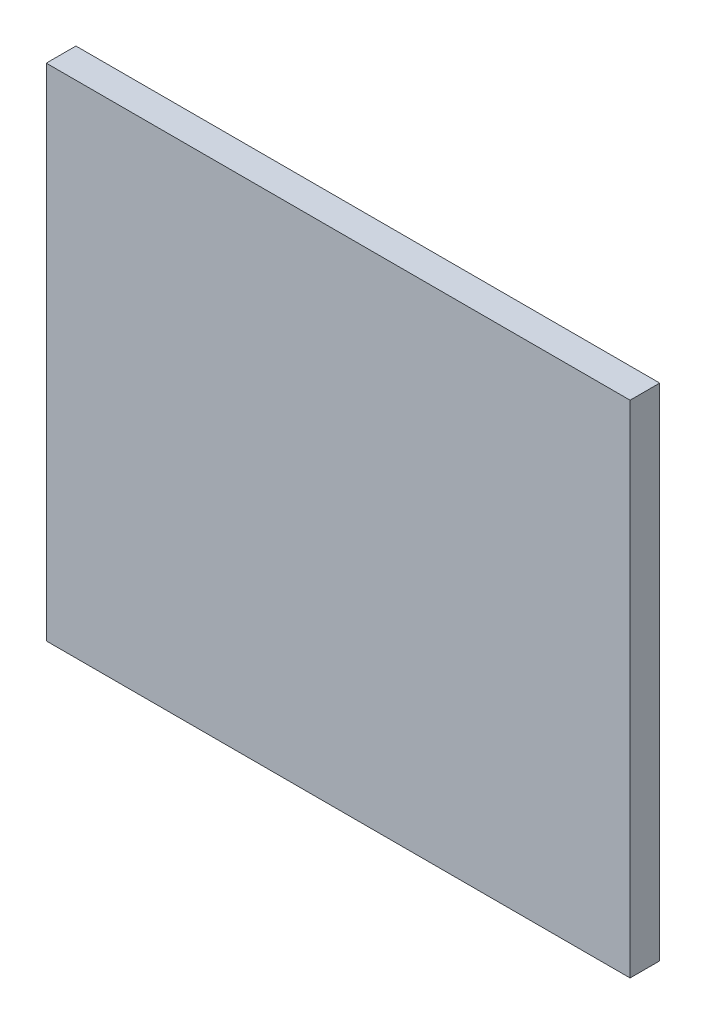
ISO-10303-21;
HEADER;
FILE_DESCRIPTION(('STEP AP214'),'2;1');
FILE_NAME('part.step','',(''),(''),'','','');
FILE_SCHEMA(('AUTOMOTIVE_DESIGN { 1 0 10303 214 1 1 1 1 }'));
ENDSEC;
DATA;
#1=APPLICATION_CONTEXT('core data for automotive mechanical design processes');
#2=APPLICATION_PROTOCOL_DEFINITION('international standard','automotive_design',2000,#1);
#3=PRODUCT_CONTEXT('',#1,'mechanical');
#4=PRODUCT('Part','Part','',(#3));
#5=PRODUCT_RELATED_PRODUCT_CATEGORY('part','',(#4));
#6=PRODUCT_DEFINITION_FORMATION('','',#4);
#7=PRODUCT_DEFINITION_CONTEXT('part definition',#1,'design');
#8=PRODUCT_DEFINITION('design','',#6,#7);
#9=PRODUCT_DEFINITION_SHAPE('','',#8);
#10=(LENGTH_UNIT() NAMED_UNIT(*) SI_UNIT(.MILLI.,.METRE.));
#11=(NAMED_UNIT(*) PLANE_ANGLE_UNIT() SI_UNIT($,.RADIAN.));
#12=(NAMED_UNIT(*) SI_UNIT($,.STERADIAN.) SOLID_ANGLE_UNIT());
#13=UNCERTAINTY_MEASURE_WITH_UNIT(LENGTH_MEASURE(1.E-05),#10,'distance_accuracy_value','');
#14=(GEOMETRIC_REPRESENTATION_CONTEXT(3) GLOBAL_UNCERTAINTY_ASSIGNED_CONTEXT((#13)) GLOBAL_UNIT_ASSIGNED_CONTEXT((#10,
#11,#12)) REPRESENTATION_CONTEXT('',''));
#15=CARTESIAN_POINT('',(0.,0.,0.));
#16=DIRECTION('',(0.,0.,1.));
#17=DIRECTION('',(1.,0.,0.));
#18=AXIS2_PLACEMENT_3D('',#15,#16,#17);
#19=CARTESIAN_POINT('',(96.7170028686523,85.9869995117188,0.));
#20=DIRECTION('',(0.,-1.,0.));
#21=DIRECTION('',(-1.,0.,0.));
#22=AXIS2_PLACEMENT_3D('',#19,#20,#21);
#23=PLANE('',#22);
#24=DIRECTION('',(-1.,0.,0.));
#25=VECTOR('',#24,1.);
#26=CARTESIAN_POINT('',(96.7170028686523,85.9869995117188,0.03556));
#27=LINE('',#26,#25);
#28=CARTESIAN_POINT('',(96.7170028686523,85.9869995117188,0.03556));
#29=VERTEX_POINT('',#28);
#30=CARTESIAN_POINT('',(96.0169982910156,85.9869995117188,0.03556));
#31=VERTEX_POINT('',#30);
#32=EDGE_CURVE('E11',#29,#31,#27,.T.);
#33=ORIENTED_EDGE('',*,*,#32,.F.);
#34=DIRECTION('',(0.,0.,1.));
#35=VECTOR('',#34,1.);
#36=CARTESIAN_POINT('',(96.7170028686523,85.9869995117188,0.));
#37=LINE('',#36,#35);
#38=CARTESIAN_POINT('',(96.7170028686523,85.9869995117188,0.));
#39=VERTEX_POINT('',#38);
#40=EDGE_CURVE('E24',#39,#29,#37,.T.);
#41=ORIENTED_EDGE('',*,*,#40,.F.);
#42=DIRECTION('',(-1.,0.,0.));
#43=VECTOR('',#42,1.);
#44=CARTESIAN_POINT('',(96.7170028686523,85.9869995117188,0.));
#45=LINE('',#44,#43);
#46=CARTESIAN_POINT('',(96.0169982910156,85.9869995117188,0.));
#47=VERTEX_POINT('',#46);
#48=EDGE_CURVE('E75',#39,#47,#45,.T.);
#49=ORIENTED_EDGE('',*,*,#48,.T.);
#50=DIRECTION('',(0.,0.,1.));
#51=VECTOR('',#50,1.);
#52=CARTESIAN_POINT('',(96.0169982910156,85.9869995117188,0.));
#53=LINE('',#52,#51);
#54=EDGE_CURVE('E37',#47,#31,#53,.T.);
#55=ORIENTED_EDGE('',*,*,#54,.T.);
#56=EDGE_LOOP('',(#33,#41,#49,#55));
#57=FACE_BOUND('',#56,.T.);
#58=ADVANCED_FACE('F17',(#57),#23,.F.);
#59=CARTESIAN_POINT('',(96.0169982910156,85.9869995117188,0.));
#60=DIRECTION('',(1.,0.,0.));
#61=DIRECTION('',(0.,-1.,0.));
#62=AXIS2_PLACEMENT_3D('',#59,#60,#61);
#63=PLANE('',#62);
#64=DIRECTION('',(0.,-1.,0.));
#65=VECTOR('',#64,1.);
#66=CARTESIAN_POINT('',(96.0169982910156,85.9869995117188,0.03556));
#67=LINE('',#66,#65);
#68=CARTESIAN_POINT('',(96.0169982910156,85.3870010375977,0.03556));
#69=VERTEX_POINT('',#68);
#70=EDGE_CURVE('E83',#31,#69,#67,.T.);
#71=ORIENTED_EDGE('',*,*,#70,.F.);
#72=ORIENTED_EDGE('',*,*,#54,.F.);
#73=DIRECTION('',(0.,-1.,0.));
#74=VECTOR('',#73,1.);
#75=CARTESIAN_POINT('',(96.0169982910156,85.9869995117188,0.));
#76=LINE('',#75,#74);
#77=CARTESIAN_POINT('',(96.0169982910156,85.3870010375977,0.));
#78=VERTEX_POINT('',#77);
#79=EDGE_CURVE('E81',#47,#78,#76,.T.);
#80=ORIENTED_EDGE('',*,*,#79,.T.);
#81=DIRECTION('',(0.,0.,1.));
#82=VECTOR('',#81,1.);
#83=CARTESIAN_POINT('',(96.0169982910156,85.3870010375977,0.));
#84=LINE('',#83,#82);
#85=EDGE_CURVE('E67',#78,#69,#84,.T.);
#86=ORIENTED_EDGE('',*,*,#85,.T.);
#87=EDGE_LOOP('',(#71,#72,#80,#86));
#88=FACE_BOUND('',#87,.T.);
#89=ADVANCED_FACE('F89',(#88),#63,.F.);
#90=CARTESIAN_POINT('',(96.0169982910156,85.3870010375977,0.));
#91=DIRECTION('',(0.,1.,0.));
#92=DIRECTION('',(1.,0.,0.));
#93=AXIS2_PLACEMENT_3D('',#90,#91,#92);
#94=PLANE('',#93);
#95=DIRECTION('',(1.,0.,0.));
#96=VECTOR('',#95,1.);
#97=CARTESIAN_POINT('',(96.0169982910156,85.3870010375977,0.03556));
#98=LINE('',#97,#96);
#99=CARTESIAN_POINT('',(96.7170028686523,85.3870010375977,0.03556));
#100=VERTEX_POINT('',#99);
#101=EDGE_CURVE('E71',#69,#100,#98,.T.);
#102=ORIENTED_EDGE('',*,*,#101,.F.);
#103=ORIENTED_EDGE('',*,*,#85,.F.);
#104=DIRECTION('',(1.,0.,0.));
#105=VECTOR('',#104,1.);
#106=CARTESIAN_POINT('',(96.0169982910156,85.3870010375977,0.));
#107=LINE('',#106,#105);
#108=CARTESIAN_POINT('',(96.7170028686523,85.3870010375977,0.));
#109=VERTEX_POINT('',#108);
#110=EDGE_CURVE('E63',#78,#109,#107,.T.);
#111=ORIENTED_EDGE('',*,*,#110,.T.);
#112=DIRECTION('',(0.,0.,1.));
#113=VECTOR('',#112,1.);
#114=CARTESIAN_POINT('',(96.7170028686523,85.3870010375977,0.));
#115=LINE('',#114,#113);
#116=EDGE_CURVE('E53',#109,#100,#115,.T.);
#117=ORIENTED_EDGE('',*,*,#116,.T.);
#118=EDGE_LOOP('',(#102,#103,#111,#117));
#119=FACE_BOUND('',#118,.T.);
#120=ADVANCED_FACE('F66',(#119),#94,.F.);
#121=CARTESIAN_POINT('',(96.7170028686523,85.3870010375977,0.));
#122=DIRECTION('',(-1.,0.,0.));
#123=DIRECTION('',(0.,1.,0.));
#124=AXIS2_PLACEMENT_3D('',#121,#122,#123);
#125=PLANE('',#124);
#126=DIRECTION('',(0.,1.,0.));
#127=VECTOR('',#126,1.);
#128=CARTESIAN_POINT('',(96.7170028686523,85.3870010375977,0.03556));
#129=LINE('',#128,#127);
#130=EDGE_CURVE('E59',#100,#29,#129,.T.);
#131=ORIENTED_EDGE('',*,*,#130,.F.);
#132=ORIENTED_EDGE('',*,*,#116,.F.);
#133=DIRECTION('',(0.,1.,0.));
#134=VECTOR('',#133,1.);
#135=CARTESIAN_POINT('',(96.7170028686523,85.3870010375977,0.));
#136=LINE('',#135,#134);
#137=EDGE_CURVE('E57',#109,#39,#136,.T.);
#138=ORIENTED_EDGE('',*,*,#137,.T.);
#139=ORIENTED_EDGE('',*,*,#40,.T.);
#140=EDGE_LOOP('',(#131,#132,#138,#139));
#141=FACE_BOUND('',#140,.T.);
#142=ADVANCED_FACE('F55',(#141),#125,.F.);
#143=CARTESIAN_POINT('',(96.7170028686523,85.9869995117188,0.));
#144=DIRECTION('',(0.,0.,-1.));
#145=DIRECTION('',(-1.,0.,0.));
#146=AXIS2_PLACEMENT_3D('',#143,#144,#145);
#147=PLANE('',#146);
#148=ORIENTED_EDGE('',*,*,#137,.F.);
#149=ORIENTED_EDGE('',*,*,#110,.F.);
#150=ORIENTED_EDGE('',*,*,#79,.F.);
#151=ORIENTED_EDGE('',*,*,#48,.F.);
#152=EDGE_LOOP('',(#148,#149,#150,#151));
#153=FACE_BOUND('',#152,.T.);
#154=ADVANCED_FACE('F74',(#153),#147,.T.);
#155=CARTESIAN_POINT('',(96.7170028686523,85.9869995117188,0.03556));
#156=DIRECTION('',(0.,0.,-1.));
#157=DIRECTION('',(-1.,0.,0.));
#158=AXIS2_PLACEMENT_3D('',#155,#156,#157);
#159=PLANE('',#158);
#160=ORIENTED_EDGE('',*,*,#32,.T.);
#161=ORIENTED_EDGE('',*,*,#70,.T.);
#162=ORIENTED_EDGE('',*,*,#101,.T.);
#163=ORIENTED_EDGE('',*,*,#130,.T.);
#164=EDGE_LOOP('',(#160,#161,#162,#163));
#165=FACE_BOUND('',#164,.T.);
#166=ADVANCED_FACE('F91',(#165),#159,.F.);
#167=CLOSED_SHELL('',(#58,#89,#120,#142,#154,#166));
#168=MANIFOLD_SOLID_BREP('B1',#167);
#169=ADVANCED_BREP_SHAPE_REPRESENTATION('',(#18,#168),#14);
#170=SHAPE_DEFINITION_REPRESENTATION(#9,#169);
ENDSEC;
END-ISO-10303-21;
